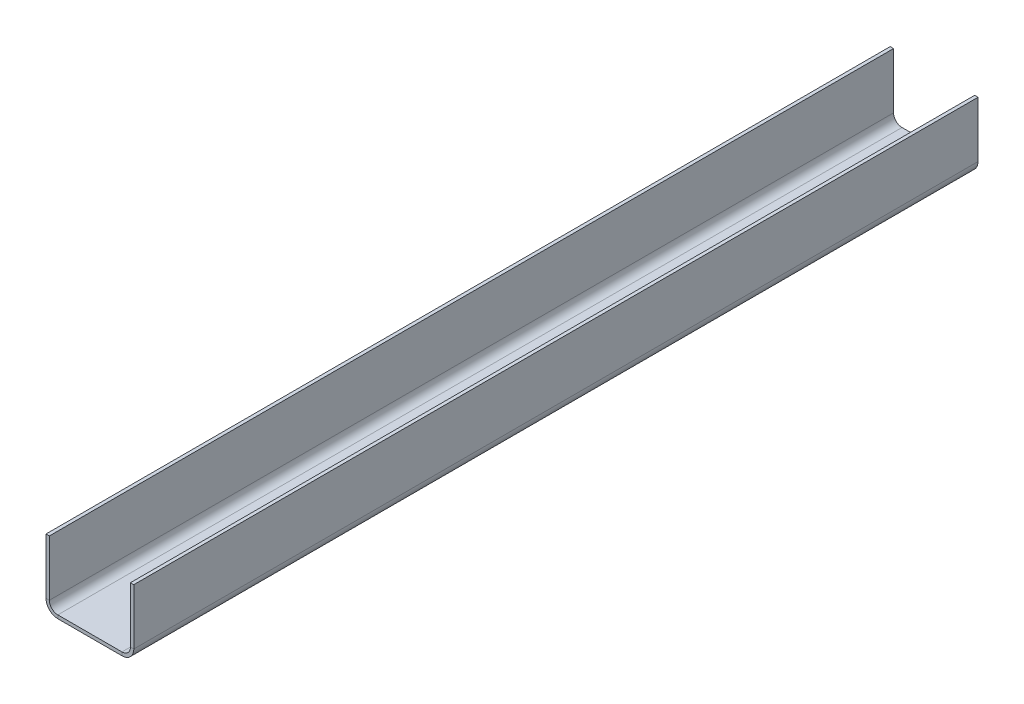
ISO-10303-21;
HEADER;
FILE_DESCRIPTION(('STEP AP214'),'2;1');
FILE_NAME('part.step','',(''),(''),'','','');
FILE_SCHEMA(('AUTOMOTIVE_DESIGN { 1 0 10303 214 1 1 1 1 }'));
ENDSEC;
DATA;
#1=APPLICATION_CONTEXT('core data for automotive mechanical design processes');
#2=APPLICATION_PROTOCOL_DEFINITION('international standard','automotive_design',2000,#1);
#3=PRODUCT_CONTEXT('',#1,'mechanical');
#4=PRODUCT('Part','Part','',(#3));
#5=PRODUCT_RELATED_PRODUCT_CATEGORY('part','',(#4));
#6=PRODUCT_DEFINITION_FORMATION('','',#4);
#7=PRODUCT_DEFINITION_CONTEXT('part definition',#1,'design');
#8=PRODUCT_DEFINITION('design','',#6,#7);
#9=PRODUCT_DEFINITION_SHAPE('','',#8);
#10=(LENGTH_UNIT() NAMED_UNIT(*) SI_UNIT(.MILLI.,.METRE.));
#11=(NAMED_UNIT(*) PLANE_ANGLE_UNIT() SI_UNIT($,.RADIAN.));
#12=(NAMED_UNIT(*) SI_UNIT($,.STERADIAN.) SOLID_ANGLE_UNIT());
#13=UNCERTAINTY_MEASURE_WITH_UNIT(LENGTH_MEASURE(1.E-05),#10,'distance_accuracy_value','');
#14=(GEOMETRIC_REPRESENTATION_CONTEXT(3) GLOBAL_UNCERTAINTY_ASSIGNED_CONTEXT((#13)) GLOBAL_UNIT_ASSIGNED_CONTEXT((#10,
#11,#12)) REPRESENTATION_CONTEXT('',''));
#15=CARTESIAN_POINT('',(0.,0.,0.));
#16=DIRECTION('',(0.,0.,1.));
#17=DIRECTION('',(1.,0.,0.));
#18=AXIS2_PLACEMENT_3D('',#15,#16,#17);
#19=CARTESIAN_POINT('',(25.,-190.,2500.));
#20=DIRECTION('',(0.,0.,1.));
#21=DIRECTION('',(1.,0.,0.));
#22=AXIS2_PLACEMENT_3D('',#19,#20,#21);
#23=PLANE('',#22);
#24=DIRECTION('',(0.,-1.,0.));
#25=VECTOR('',#24,1.);
#26=CARTESIAN_POINT('',(25.,-190.,2500.));
#27=LINE('',#26,#25);
#28=CARTESIAN_POINT('',(25.,-190.,2500.));
#29=VERTEX_POINT('',#28);
#30=CARTESIAN_POINT('',(25.,-200.,2500.));
#31=VERTEX_POINT('',#30);
#32=EDGE_CURVE('E11',#29,#31,#27,.T.);
#33=ORIENTED_EDGE('',*,*,#32,.F.);
#34=CARTESIAN_POINT('',(25.,-165.,2500.));
#35=DIRECTION('',(0.,0.,-1.));
#36=DIRECTION('',(-1.,0.,0.));
#37=AXIS2_PLACEMENT_3D('',#34,#35,#36);
#38=CIRCLE('',#37,25.);
#39=CARTESIAN_POINT('',(0.,-165.,2500.));
#40=VERTEX_POINT('',#39);
#41=EDGE_CURVE('E249',#40,#29,#38,.F.);
#42=ORIENTED_EDGE('',*,*,#41,.F.);
#43=DIRECTION('',(1.,0.,0.));
#44=VECTOR('',#43,1.);
#45=CARTESIAN_POINT('',(-9.99999999999998,-165.,2500.));
#46=LINE('',#45,#44);
#47=CARTESIAN_POINT('',(-9.99999999999998,-165.,2500.));
#48=VERTEX_POINT('',#47);
#49=EDGE_CURVE('E47',#48,#40,#46,.T.);
#50=ORIENTED_EDGE('',*,*,#49,.F.);
#51=CARTESIAN_POINT('',(25.,-165.,2500.));
#52=DIRECTION('',(0.,0.,1.));
#53=DIRECTION('',(1.,0.,0.));
#54=AXIS2_PLACEMENT_3D('',#51,#52,#53);
#55=CIRCLE('',#54,35.);
#56=EDGE_CURVE('E148',#48,#31,#55,.T.);
#57=ORIENTED_EDGE('',*,*,#56,.T.);
#58=EDGE_LOOP('',(#33,#42,#50,#57));
#59=FACE_BOUND('',#58,.T.);
#60=ADVANCED_FACE('F39',(#59),#23,.T.);
#61=CARTESIAN_POINT('',(-9.99999999999998,-165.,2500.));
#62=DIRECTION('',(0.,0.,1.));
#63=DIRECTION('',(1.,0.,0.));
#64=AXIS2_PLACEMENT_3D('',#61,#62,#63);
#65=PLANE('',#64);
#66=DIRECTION('',(1.,0.,0.));
#67=VECTOR('',#66,1.);
#68=CARTESIAN_POINT('',(0.,-190.,2500.));
#69=LINE('',#68,#67);
#70=CARTESIAN_POINT('',(215.,-190.,2500.));
#71=VERTEX_POINT('',#70);
#72=EDGE_CURVE('E142',#29,#71,#69,.T.);
#73=ORIENTED_EDGE('',*,*,#72,.F.);
#74=ORIENTED_EDGE('',*,*,#32,.T.);
#75=DIRECTION('',(1.,0.,0.));
#76=VECTOR('',#75,1.);
#77=CARTESIAN_POINT('',(0.,-200.,2500.));
#78=LINE('',#77,#76);
#79=CARTESIAN_POINT('',(215.,-200.,2500.));
#80=VERTEX_POINT('',#79);
#81=EDGE_CURVE('E139',#31,#80,#78,.T.);
#82=ORIENTED_EDGE('',*,*,#81,.T.);
#83=DIRECTION('',(0.,1.,0.));
#84=VECTOR('',#83,1.);
#85=CARTESIAN_POINT('',(215.,-200.,2500.));
#86=LINE('',#85,#84);
#87=EDGE_CURVE('E230',#80,#71,#86,.T.);
#88=ORIENTED_EDGE('',*,*,#87,.T.);
#89=EDGE_LOOP('',(#73,#74,#82,#88));
#90=FACE_BOUND('',#89,.T.);
#91=ADVANCED_FACE('F137',(#90),#65,.T.);
#92=CARTESIAN_POINT('',(0.,-165.,0.));
#93=DIRECTION('',(0.,0.,-1.));
#94=DIRECTION('',(-1.,0.,0.));
#95=AXIS2_PLACEMENT_3D('',#92,#93,#94);
#96=PLANE('',#95);
#97=DIRECTION('',(-1.,0.,0.));
#98=VECTOR('',#97,1.);
#99=CARTESIAN_POINT('',(0.,-165.,0.));
#100=LINE('',#99,#98);
#101=CARTESIAN_POINT('',(0.,-165.,0.));
#102=VERTEX_POINT('',#101);
#103=CARTESIAN_POINT('',(-9.99999999999998,-165.,0.));
#104=VERTEX_POINT('',#103);
#105=EDGE_CURVE('E235',#102,#104,#100,.T.);
#106=ORIENTED_EDGE('',*,*,#105,.F.);
#107=CARTESIAN_POINT('',(25.,-165.,0.));
#108=DIRECTION('',(0.,0.,-1.));
#109=DIRECTION('',(-1.,0.,0.));
#110=AXIS2_PLACEMENT_3D('',#107,#108,#109);
#111=CIRCLE('',#110,25.);
#112=CARTESIAN_POINT('',(25.,-190.,0.));
#113=VERTEX_POINT('',#112);
#114=EDGE_CURVE('E187',#102,#113,#111,.F.);
#115=ORIENTED_EDGE('',*,*,#114,.T.);
#116=DIRECTION('',(0.,1.,0.));
#117=VECTOR('',#116,1.);
#118=CARTESIAN_POINT('',(25.,-200.,0.));
#119=LINE('',#118,#117);
#120=CARTESIAN_POINT('',(25.,-200.,0.));
#121=VERTEX_POINT('',#120);
#122=EDGE_CURVE('E233',#121,#113,#119,.T.);
#123=ORIENTED_EDGE('',*,*,#122,.F.);
#124=CARTESIAN_POINT('',(25.,-165.,0.));
#125=DIRECTION('',(0.,0.,1.));
#126=DIRECTION('',(1.,0.,0.));
#127=AXIS2_PLACEMENT_3D('',#124,#125,#126);
#128=CIRCLE('',#127,35.);
#129=EDGE_CURVE('E160',#104,#121,#128,.T.);
#130=ORIENTED_EDGE('',*,*,#129,.F.);
#131=EDGE_LOOP('',(#106,#115,#123,#130));
#132=FACE_BOUND('',#131,.T.);
#133=ADVANCED_FACE('F287',(#132),#96,.T.);
#134=CARTESIAN_POINT('',(25.,-200.,0.));
#135=DIRECTION('',(0.,0.,-1.));
#136=DIRECTION('',(-1.,0.,0.));
#137=AXIS2_PLACEMENT_3D('',#134,#135,#136);
#138=PLANE('',#137);
#139=DIRECTION('',(0.,-1.,0.));
#140=VECTOR('',#139,1.);
#141=CARTESIAN_POINT('',(0.,0.,0.));
#142=LINE('',#141,#140);
#143=CARTESIAN_POINT('',(0.,0.,0.));
#144=VERTEX_POINT('',#143);
#145=EDGE_CURVE('E190',#144,#102,#142,.T.);
#146=ORIENTED_EDGE('',*,*,#145,.T.);
#147=ORIENTED_EDGE('',*,*,#105,.T.);
#148=DIRECTION('',(0.,-1.,0.));
#149=VECTOR('',#148,1.);
#150=CARTESIAN_POINT('',(-10.,0.,0.));
#151=LINE('',#150,#149);
#152=CARTESIAN_POINT('',(-10.,0.,0.));
#153=VERTEX_POINT('',#152);
#154=EDGE_CURVE('E196',#153,#104,#151,.T.);
#155=ORIENTED_EDGE('',*,*,#154,.F.);
#156=DIRECTION('',(1.,0.,0.));
#157=VECTOR('',#156,1.);
#158=CARTESIAN_POINT('',(-10.,0.,0.));
#159=LINE('',#158,#157);
#160=EDGE_CURVE('E193',#153,#144,#159,.T.);
#161=ORIENTED_EDGE('',*,*,#160,.T.);
#162=EDGE_LOOP('',(#146,#147,#155,#161));
#163=FACE_BOUND('',#162,.T.);
#164=ADVANCED_FACE('F290',(#163),#138,.T.);
#165=CARTESIAN_POINT('',(240.,-165.,2500.));
#166=DIRECTION('',(0.,0.,1.));
#167=DIRECTION('',(1.,0.,0.));
#168=AXIS2_PLACEMENT_3D('',#165,#166,#167);
#169=PLANE('',#168);
#170=DIRECTION('',(1.,0.,0.));
#171=VECTOR('',#170,1.);
#172=CARTESIAN_POINT('',(240.,-165.,2500.));
#173=LINE('',#172,#171);
#174=CARTESIAN_POINT('',(240.,-165.,2500.));
#175=VERTEX_POINT('',#174);
#176=CARTESIAN_POINT('',(250.,-165.,2500.));
#177=VERTEX_POINT('',#176);
#178=EDGE_CURVE('E55',#175,#177,#173,.T.);
#179=ORIENTED_EDGE('',*,*,#178,.F.);
#180=CARTESIAN_POINT('',(215.,-165.,2500.));
#181=DIRECTION('',(0.,0.,-1.));
#182=DIRECTION('',(-1.,0.,0.));
#183=AXIS2_PLACEMENT_3D('',#180,#181,#182);
#184=CIRCLE('',#183,25.);
#185=EDGE_CURVE('E259',#71,#175,#184,.F.);
#186=ORIENTED_EDGE('',*,*,#185,.F.);
#187=ORIENTED_EDGE('',*,*,#87,.F.);
#188=CARTESIAN_POINT('',(215.,-165.,2500.));
#189=DIRECTION('',(0.,0.,1.));
#190=DIRECTION('',(1.,0.,0.));
#191=AXIS2_PLACEMENT_3D('',#188,#189,#190);
#192=CIRCLE('',#191,35.);
#193=EDGE_CURVE('E168',#80,#177,#192,.T.);
#194=ORIENTED_EDGE('',*,*,#193,.T.);
#195=EDGE_LOOP('',(#179,#186,#187,#194));
#196=FACE_BOUND('',#195,.T.);
#197=ADVANCED_FACE('F282',(#196),#169,.T.);
#198=CARTESIAN_POINT('',(215.,-200.,2500.));
#199=DIRECTION('',(0.,0.,1.));
#200=DIRECTION('',(1.,0.,0.));
#201=AXIS2_PLACEMENT_3D('',#198,#199,#200);
#202=PLANE('',#201);
#203=DIRECTION('',(0.,1.,0.));
#204=VECTOR('',#203,1.);
#205=CARTESIAN_POINT('',(240.,-190.,2500.));
#206=LINE('',#205,#204);
#207=CARTESIAN_POINT('',(240.,0.,2500.));
#208=VERTEX_POINT('',#207);
#209=EDGE_CURVE('E262',#175,#208,#206,.T.);
#210=ORIENTED_EDGE('',*,*,#209,.F.);
#211=ORIENTED_EDGE('',*,*,#178,.T.);
#212=DIRECTION('',(0.,1.,0.));
#213=VECTOR('',#212,1.);
#214=CARTESIAN_POINT('',(250.,-190.,2500.));
#215=LINE('',#214,#213);
#216=CARTESIAN_POINT('',(250.,0.,2500.));
#217=VERTEX_POINT('',#216);
#218=EDGE_CURVE('E109',#177,#217,#215,.T.);
#219=ORIENTED_EDGE('',*,*,#218,.T.);
#220=DIRECTION('',(1.,0.,0.));
#221=VECTOR('',#220,1.);
#222=CARTESIAN_POINT('',(240.,0.,2500.));
#223=LINE('',#222,#221);
#224=EDGE_CURVE('E265',#208,#217,#223,.T.);
#225=ORIENTED_EDGE('',*,*,#224,.F.);
#226=EDGE_LOOP('',(#210,#211,#219,#225));
#227=FACE_BOUND('',#226,.T.);
#228=ADVANCED_FACE('F271',(#227),#202,.T.);
#229=CARTESIAN_POINT('',(215.,-190.,0.));
#230=DIRECTION('',(0.,0.,-1.));
#231=DIRECTION('',(-1.,0.,0.));
#232=AXIS2_PLACEMENT_3D('',#229,#230,#231);
#233=PLANE('',#232);
#234=DIRECTION('',(0.,-1.,0.));
#235=VECTOR('',#234,1.);
#236=CARTESIAN_POINT('',(215.,-190.,0.));
#237=LINE('',#236,#235);
#238=CARTESIAN_POINT('',(215.,-190.,0.));
#239=VERTEX_POINT('',#238);
#240=CARTESIAN_POINT('',(215.,-200.,0.));
#241=VERTEX_POINT('',#240);
#242=EDGE_CURVE('E96',#239,#241,#237,.T.);
#243=ORIENTED_EDGE('',*,*,#242,.F.);
#244=CARTESIAN_POINT('',(215.,-165.,0.));
#245=DIRECTION('',(0.,0.,-1.));
#246=DIRECTION('',(-1.,0.,0.));
#247=AXIS2_PLACEMENT_3D('',#244,#245,#246);
#248=CIRCLE('',#247,25.);
#249=CARTESIAN_POINT('',(240.,-165.,0.));
#250=VERTEX_POINT('',#249);
#251=EDGE_CURVE('E183',#239,#250,#248,.F.);
#252=ORIENTED_EDGE('',*,*,#251,.T.);
#253=DIRECTION('',(-1.,0.,0.));
#254=VECTOR('',#253,1.);
#255=CARTESIAN_POINT('',(250.,-165.,0.));
#256=LINE('',#255,#254);
#257=CARTESIAN_POINT('',(250.,-165.,0.));
#258=VERTEX_POINT('',#257);
#259=EDGE_CURVE('E103',#258,#250,#256,.T.);
#260=ORIENTED_EDGE('',*,*,#259,.F.);
#261=CARTESIAN_POINT('',(215.,-165.,0.));
#262=DIRECTION('',(0.,0.,1.));
#263=DIRECTION('',(1.,0.,0.));
#264=AXIS2_PLACEMENT_3D('',#261,#262,#263);
#265=CIRCLE('',#264,35.);
#266=EDGE_CURVE('E202',#241,#258,#265,.T.);
#267=ORIENTED_EDGE('',*,*,#266,.F.);
#268=EDGE_LOOP('',(#243,#252,#260,#267));
#269=FACE_BOUND('',#268,.T.);
#270=ADVANCED_FACE('F319',(#269),#233,.T.);
#271=CARTESIAN_POINT('',(250.,-165.,0.));
#272=DIRECTION('',(0.,0.,-1.));
#273=DIRECTION('',(-1.,0.,0.));
#274=AXIS2_PLACEMENT_3D('',#271,#272,#273);
#275=PLANE('',#274);
#276=DIRECTION('',(1.,0.,0.));
#277=VECTOR('',#276,1.);
#278=CARTESIAN_POINT('',(0.,-190.,0.));
#279=LINE('',#278,#277);
#280=EDGE_CURVE('E185',#113,#239,#279,.T.);
#281=ORIENTED_EDGE('',*,*,#280,.T.);
#282=ORIENTED_EDGE('',*,*,#242,.T.);
#283=DIRECTION('',(1.,0.,0.));
#284=VECTOR('',#283,1.);
#285=CARTESIAN_POINT('',(0.,-200.,0.));
#286=LINE('',#285,#284);
#287=EDGE_CURVE('E200',#121,#241,#286,.T.);
#288=ORIENTED_EDGE('',*,*,#287,.F.);
#289=ORIENTED_EDGE('',*,*,#122,.T.);
#290=EDGE_LOOP('',(#281,#282,#288,#289));
#291=FACE_BOUND('',#290,.T.);
#292=ADVANCED_FACE('F322',(#291),#275,.T.);
#293=CARTESIAN_POINT('',(250.,-190.,2500.));
#294=DIRECTION('',(-1.,0.,0.));
#295=DIRECTION('',(0.,0.,1.));
#296=AXIS2_PLACEMENT_3D('',#293,#294,#295);
#297=PLANE('',#296);
#298=DIRECTION('',(0.,1.,0.));
#299=VECTOR('',#298,1.);
#300=CARTESIAN_POINT('',(250.,-190.,0.));
#301=LINE('',#300,#299);
#302=CARTESIAN_POINT('',(250.,0.,0.));
#303=VERTEX_POINT('',#302);
#304=EDGE_CURVE('E174',#258,#303,#301,.T.);
#305=ORIENTED_EDGE('',*,*,#304,.T.);
#306=DIRECTION('',(0.,0.,-1.));
#307=VECTOR('',#306,1.);
#308=CARTESIAN_POINT('',(250.,0.,2500.));
#309=LINE('',#308,#307);
#310=EDGE_CURVE('E226',#217,#303,#309,.T.);
#311=ORIENTED_EDGE('',*,*,#310,.F.);
#312=ORIENTED_EDGE('',*,*,#218,.F.);
#313=DIRECTION('',(0.,0.,-1.));
#314=VECTOR('',#313,1.);
#315=CARTESIAN_POINT('',(250.,-165.,2500.));
#316=LINE('',#315,#314);
#317=EDGE_CURVE('E170',#177,#258,#316,.T.);
#318=ORIENTED_EDGE('',*,*,#317,.T.);
#319=EDGE_LOOP('',(#305,#311,#312,#318));
#320=FACE_BOUND('',#319,.T.);
#321=ADVANCED_FACE('F325',(#320),#297,.F.);
#322=CARTESIAN_POINT('',(240.,0.,2500.));
#323=DIRECTION('',(0.,1.,0.));
#324=DIRECTION('',(0.,0.,1.));
#325=AXIS2_PLACEMENT_3D('',#322,#323,#324);
#326=PLANE('',#325);
#327=DIRECTION('',(1.,0.,0.));
#328=VECTOR('',#327,1.);
#329=CARTESIAN_POINT('',(240.,0.,0.));
#330=LINE('',#329,#328);
#331=CARTESIAN_POINT('',(240.,0.,0.));
#332=VERTEX_POINT('',#331);
#333=EDGE_CURVE('E177',#332,#303,#330,.T.);
#334=ORIENTED_EDGE('',*,*,#333,.F.);
#335=DIRECTION('',(0.,0.,-1.));
#336=VECTOR('',#335,1.);
#337=CARTESIAN_POINT('',(240.,0.,2500.));
#338=LINE('',#337,#336);
#339=EDGE_CURVE('E224',#208,#332,#338,.T.);
#340=ORIENTED_EDGE('',*,*,#339,.F.);
#341=ORIENTED_EDGE('',*,*,#224,.T.);
#342=ORIENTED_EDGE('',*,*,#310,.T.);
#343=EDGE_LOOP('',(#334,#340,#341,#342));
#344=FACE_BOUND('',#343,.T.);
#345=ADVANCED_FACE('F270',(#344),#326,.T.);
#346=CARTESIAN_POINT('',(240.,-190.,2500.));
#347=DIRECTION('',(-1.,0.,0.));
#348=DIRECTION('',(0.,0.,1.));
#349=AXIS2_PLACEMENT_3D('',#346,#347,#348);
#350=PLANE('',#349);
#351=DIRECTION('',(0.,1.,0.));
#352=VECTOR('',#351,1.);
#353=CARTESIAN_POINT('',(240.,-190.,0.));
#354=LINE('',#353,#352);
#355=EDGE_CURVE('E180',#250,#332,#354,.T.);
#356=ORIENTED_EDGE('',*,*,#355,.F.);
#357=DIRECTION('',(0.,0.,-1.));
#358=VECTOR('',#357,1.);
#359=CARTESIAN_POINT('',(240.,-165.,2500.));
#360=LINE('',#359,#358);
#361=EDGE_CURVE('E221',#175,#250,#360,.T.);
#362=ORIENTED_EDGE('',*,*,#361,.F.);
#363=ORIENTED_EDGE('',*,*,#209,.T.);
#364=ORIENTED_EDGE('',*,*,#339,.T.);
#365=EDGE_LOOP('',(#356,#362,#363,#364));
#366=FACE_BOUND('',#365,.T.);
#367=ADVANCED_FACE('F275',(#366),#350,.T.);
#368=CARTESIAN_POINT('',(215.,-165.,2500.));
#369=DIRECTION('',(0.,0.,-1.));
#370=DIRECTION('',(-1.,0.,0.));
#371=AXIS2_PLACEMENT_3D('',#368,#369,#370);
#372=CYLINDRICAL_SURFACE('',#371,25.);
#373=ORIENTED_EDGE('',*,*,#251,.F.);
#374=DIRECTION('',(0.,0.,-1.));
#375=VECTOR('',#374,1.);
#376=CARTESIAN_POINT('',(215.,-190.,2500.));
#377=LINE('',#376,#375);
#378=EDGE_CURVE('E218',#71,#239,#377,.T.);
#379=ORIENTED_EDGE('',*,*,#378,.F.);
#380=ORIENTED_EDGE('',*,*,#185,.T.);
#381=ORIENTED_EDGE('',*,*,#361,.T.);
#382=EDGE_LOOP('',(#373,#379,#380,#381));
#383=FACE_BOUND('',#382,.T.);
#384=ADVANCED_FACE('F278',(#383),#372,.F.);
#385=CARTESIAN_POINT('',(0.,-190.,2500.));
#386=DIRECTION('',(0.,1.,0.));
#387=DIRECTION('',(0.,0.,1.));
#388=AXIS2_PLACEMENT_3D('',#385,#386,#387);
#389=PLANE('',#388);
#390=ORIENTED_EDGE('',*,*,#280,.F.);
#391=DIRECTION('',(0.,0.,-1.));
#392=VECTOR('',#391,1.);
#393=CARTESIAN_POINT('',(25.,-190.,2500.));
#394=LINE('',#393,#392);
#395=EDGE_CURVE('E215',#29,#113,#394,.T.);
#396=ORIENTED_EDGE('',*,*,#395,.F.);
#397=ORIENTED_EDGE('',*,*,#72,.T.);
#398=ORIENTED_EDGE('',*,*,#378,.T.);
#399=EDGE_LOOP('',(#390,#396,#397,#398));
#400=FACE_BOUND('',#399,.T.);
#401=ADVANCED_FACE('F285',(#400),#389,.T.);
#402=CARTESIAN_POINT('',(25.,-165.,2500.));
#403=DIRECTION('',(0.,0.,-1.));
#404=DIRECTION('',(-1.,0.,0.));
#405=AXIS2_PLACEMENT_3D('',#402,#403,#404);
#406=CYLINDRICAL_SURFACE('',#405,25.);
#407=ORIENTED_EDGE('',*,*,#114,.F.);
#408=DIRECTION('',(0.,0.,-1.));
#409=VECTOR('',#408,1.);
#410=CARTESIAN_POINT('',(0.,-165.,2500.));
#411=LINE('',#410,#409);
#412=EDGE_CURVE('E212',#40,#102,#411,.T.);
#413=ORIENTED_EDGE('',*,*,#412,.F.);
#414=ORIENTED_EDGE('',*,*,#41,.T.);
#415=ORIENTED_EDGE('',*,*,#395,.T.);
#416=EDGE_LOOP('',(#407,#413,#414,#415));
#417=FACE_BOUND('',#416,.T.);
#418=ADVANCED_FACE('F248',(#417),#406,.F.);
#419=CARTESIAN_POINT('',(0.,0.,2500.));
#420=DIRECTION('',(1.,0.,0.));
#421=DIRECTION('',(0.,1.,0.));
#422=AXIS2_PLACEMENT_3D('',#419,#420,#421);
#423=PLANE('',#422);
#424=ORIENTED_EDGE('',*,*,#145,.F.);
#425=DIRECTION('',(0.,0.,-1.));
#426=VECTOR('',#425,1.);
#427=CARTESIAN_POINT('',(0.,0.,2500.));
#428=LINE('',#427,#426);
#429=CARTESIAN_POINT('',(0.,0.,2500.));
#430=VERTEX_POINT('',#429);
#431=EDGE_CURVE('E210',#430,#144,#428,.T.);
#432=ORIENTED_EDGE('',*,*,#431,.F.);
#433=DIRECTION('',(0.,-1.,0.));
#434=VECTOR('',#433,1.);
#435=CARTESIAN_POINT('',(0.,0.,2500.));
#436=LINE('',#435,#434);
#437=EDGE_CURVE('E242',#430,#40,#436,.T.);
#438=ORIENTED_EDGE('',*,*,#437,.T.);
#439=ORIENTED_EDGE('',*,*,#412,.T.);
#440=EDGE_LOOP('',(#424,#432,#438,#439));
#441=FACE_BOUND('',#440,.T.);
#442=ADVANCED_FACE('F253',(#441),#423,.T.);
#443=CARTESIAN_POINT('',(-10.,0.,2500.));
#444=DIRECTION('',(0.,1.,0.));
#445=DIRECTION('',(-1.,0.,0.));
#446=AXIS2_PLACEMENT_3D('',#443,#444,#445);
#447=PLANE('',#446);
#448=ORIENTED_EDGE('',*,*,#160,.F.);
#449=DIRECTION('',(0.,0.,-1.));
#450=VECTOR('',#449,1.);
#451=CARTESIAN_POINT('',(-10.,0.,2500.));
#452=LINE('',#451,#450);
#453=CARTESIAN_POINT('',(-10.,0.,2500.));
#454=VERTEX_POINT('',#453);
#455=EDGE_CURVE('E208',#454,#153,#452,.T.);
#456=ORIENTED_EDGE('',*,*,#455,.F.);
#457=DIRECTION('',(1.,0.,0.));
#458=VECTOR('',#457,1.);
#459=CARTESIAN_POINT('',(-10.,0.,2500.));
#460=LINE('',#459,#458);
#461=EDGE_CURVE('E254',#454,#430,#460,.T.);
#462=ORIENTED_EDGE('',*,*,#461,.T.);
#463=ORIENTED_EDGE('',*,*,#431,.T.);
#464=EDGE_LOOP('',(#448,#456,#462,#463));
#465=FACE_BOUND('',#464,.T.);
#466=ADVANCED_FACE('F295',(#465),#447,.T.);
#467=CARTESIAN_POINT('',(-10.,0.,2500.));
#468=DIRECTION('',(1.,0.,0.));
#469=DIRECTION('',(0.,1.,0.));
#470=AXIS2_PLACEMENT_3D('',#467,#468,#469);
#471=PLANE('',#470);
#472=ORIENTED_EDGE('',*,*,#154,.T.);
#473=DIRECTION('',(0.,0.,-1.));
#474=VECTOR('',#473,1.);
#475=CARTESIAN_POINT('',(-9.99999999999998,-165.,2500.));
#476=LINE('',#475,#474);
#477=EDGE_CURVE('E162',#48,#104,#476,.T.);
#478=ORIENTED_EDGE('',*,*,#477,.F.);
#479=DIRECTION('',(0.,-1.,0.));
#480=VECTOR('',#479,1.);
#481=CARTESIAN_POINT('',(-10.,0.,2500.));
#482=LINE('',#481,#480);
#483=EDGE_CURVE('E153',#454,#48,#482,.T.);
#484=ORIENTED_EDGE('',*,*,#483,.F.);
#485=ORIENTED_EDGE('',*,*,#455,.T.);
#486=EDGE_LOOP('',(#472,#478,#484,#485));
#487=FACE_BOUND('',#486,.T.);
#488=ADVANCED_FACE('F293',(#487),#471,.F.);
#489=CARTESIAN_POINT('',(25.,-165.,2500.));
#490=DIRECTION('',(0.,0.,-1.));
#491=DIRECTION('',(-1.,0.,0.));
#492=AXIS2_PLACEMENT_3D('',#489,#490,#491);
#493=CYLINDRICAL_SURFACE('',#492,35.);
#494=ORIENTED_EDGE('',*,*,#129,.T.);
#495=DIRECTION('',(0.,0.,-1.));
#496=VECTOR('',#495,1.);
#497=CARTESIAN_POINT('',(25.,-200.,2500.));
#498=LINE('',#497,#496);
#499=EDGE_CURVE('E157',#31,#121,#498,.T.);
#500=ORIENTED_EDGE('',*,*,#499,.F.);
#501=ORIENTED_EDGE('',*,*,#56,.F.);
#502=ORIENTED_EDGE('',*,*,#477,.T.);
#503=EDGE_LOOP('',(#494,#500,#501,#502));
#504=FACE_BOUND('',#503,.T.);
#505=ADVANCED_FACE('F158',(#504),#493,.T.);
#506=CARTESIAN_POINT('',(0.,-200.,2500.));
#507=DIRECTION('',(0.,1.,0.));
#508=DIRECTION('',(0.,0.,1.));
#509=AXIS2_PLACEMENT_3D('',#506,#507,#508);
#510=PLANE('',#509);
#511=ORIENTED_EDGE('',*,*,#287,.T.);
#512=DIRECTION('',(0.,0.,-1.));
#513=VECTOR('',#512,1.);
#514=CARTESIAN_POINT('',(215.,-200.,2500.));
#515=LINE('',#514,#513);
#516=EDGE_CURVE('E163',#80,#241,#515,.T.);
#517=ORIENTED_EDGE('',*,*,#516,.F.);
#518=ORIENTED_EDGE('',*,*,#81,.F.);
#519=ORIENTED_EDGE('',*,*,#499,.T.);
#520=EDGE_LOOP('',(#511,#517,#518,#519));
#521=FACE_BOUND('',#520,.T.);
#522=ADVANCED_FACE('F165',(#521),#510,.F.);
#523=CARTESIAN_POINT('',(215.,-165.,2500.));
#524=DIRECTION('',(0.,0.,-1.));
#525=DIRECTION('',(-1.,0.,0.));
#526=AXIS2_PLACEMENT_3D('',#523,#524,#525);
#527=CYLINDRICAL_SURFACE('',#526,35.);
#528=ORIENTED_EDGE('',*,*,#266,.T.);
#529=ORIENTED_EDGE('',*,*,#317,.F.);
#530=ORIENTED_EDGE('',*,*,#193,.F.);
#531=ORIENTED_EDGE('',*,*,#516,.T.);
#532=EDGE_LOOP('',(#528,#529,#530,#531));
#533=FACE_BOUND('',#532,.T.);
#534=ADVANCED_FACE('F377',(#533),#527,.T.);
#535=CARTESIAN_POINT('',(215.,-165.,2500.));
#536=DIRECTION('',(0.,0.,-1.));
#537=DIRECTION('',(-1.,0.,0.));
#538=AXIS2_PLACEMENT_3D('',#535,#536,#537);
#539=PLANE('',#538);
#540=ORIENTED_EDGE('',*,*,#483,.T.);
#541=ORIENTED_EDGE('',*,*,#49,.T.);
#542=ORIENTED_EDGE('',*,*,#437,.F.);
#543=ORIENTED_EDGE('',*,*,#461,.F.);
#544=EDGE_LOOP('',(#540,#541,#542,#543));
#545=FACE_BOUND('',#544,.T.);
#546=ADVANCED_FACE('F239',(#545),#539,.F.);
#547=CARTESIAN_POINT('',(215.,-165.,0.));
#548=DIRECTION('',(0.,0.,-1.));
#549=DIRECTION('',(-1.,0.,0.));
#550=AXIS2_PLACEMENT_3D('',#547,#548,#549);
#551=PLANE('',#550);
#552=ORIENTED_EDGE('',*,*,#304,.F.);
#553=ORIENTED_EDGE('',*,*,#259,.T.);
#554=ORIENTED_EDGE('',*,*,#355,.T.);
#555=ORIENTED_EDGE('',*,*,#333,.T.);
#556=EDGE_LOOP('',(#552,#553,#554,#555));
#557=FACE_BOUND('',#556,.T.);
#558=ADVANCED_FACE('F397',(#557),#551,.T.);
#559=CLOSED_SHELL('',(#60,#91,#133,#164,#197,#228,#270,#292,#321,#345,#367,#384,#401,#418,#442,
#466,#488,#505,#522,#534,#546,#558));
#560=MANIFOLD_SOLID_BREP('B2',#559);
#561=ADVANCED_BREP_SHAPE_REPRESENTATION('',(#18,#560),#14);
#562=SHAPE_DEFINITION_REPRESENTATION(#9,#561);
ENDSEC;
END-ISO-10303-21;
